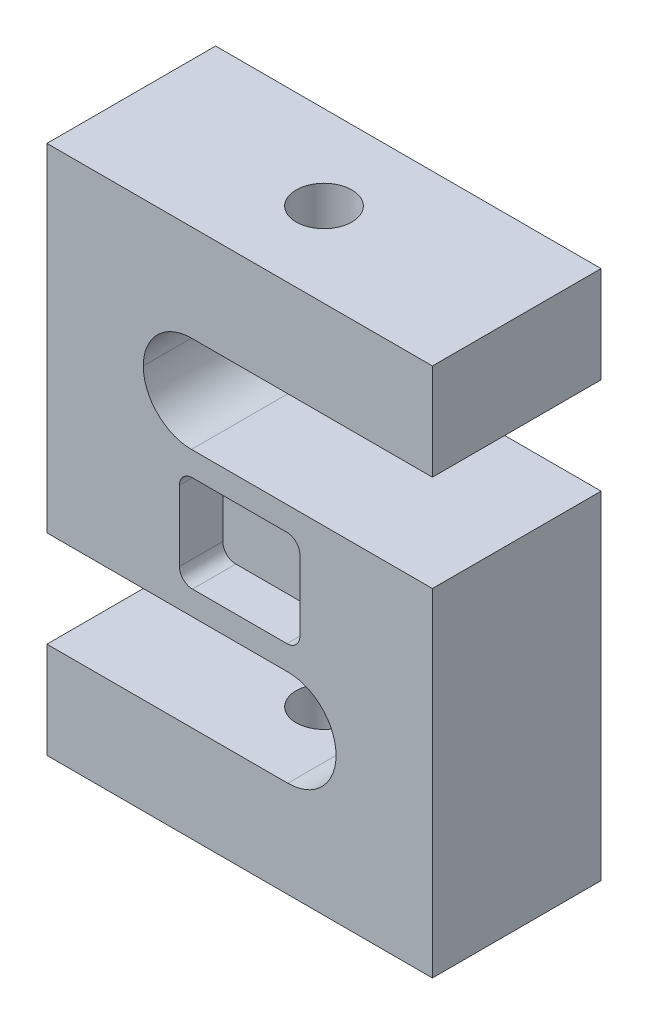
ISO-10303-21;
HEADER;
FILE_DESCRIPTION(('STEP AP214'),'2;1');
FILE_NAME('part.step','',(''),(''),'','','');
FILE_SCHEMA(('AUTOMOTIVE_DESIGN { 1 0 10303 214 1 1 1 1 }'));
ENDSEC;
DATA;
#1=APPLICATION_CONTEXT('core data for automotive mechanical design processes');
#2=APPLICATION_PROTOCOL_DEFINITION('international standard','automotive_design',2000,#1);
#3=PRODUCT_CONTEXT('',#1,'mechanical');
#4=PRODUCT('Part','Part','',(#3));
#5=PRODUCT_RELATED_PRODUCT_CATEGORY('part','',(#4));
#6=PRODUCT_DEFINITION_FORMATION('','',#4);
#7=PRODUCT_DEFINITION_CONTEXT('part definition',#1,'design');
#8=PRODUCT_DEFINITION('design','',#6,#7);
#9=PRODUCT_DEFINITION_SHAPE('','',#8);
#10=(LENGTH_UNIT() NAMED_UNIT(*) SI_UNIT(.MILLI.,.METRE.));
#11=(NAMED_UNIT(*) PLANE_ANGLE_UNIT() SI_UNIT($,.RADIAN.));
#12=(NAMED_UNIT(*) SI_UNIT($,.STERADIAN.) SOLID_ANGLE_UNIT());
#13=UNCERTAINTY_MEASURE_WITH_UNIT(LENGTH_MEASURE(1.E-05),#10,'distance_accuracy_value','');
#14=(GEOMETRIC_REPRESENTATION_CONTEXT(3) GLOBAL_UNCERTAINTY_ASSIGNED_CONTEXT((#13)) GLOBAL_UNIT_ASSIGNED_CONTEXT((#10,
#11,#12)) REPRESENTATION_CONTEXT('',''));
#15=CARTESIAN_POINT('',(0.,0.,0.));
#16=DIRECTION('',(0.,0.,1.));
#17=DIRECTION('',(1.,0.,0.));
#18=AXIS2_PLACEMENT_3D('',#15,#16,#17);
#19=CARTESIAN_POINT('',(76.2,-88.9,-22.225));
#20=DIRECTION('',(0.,0.,-1.));
#21=DIRECTION('',(-1.,0.,0.));
#22=AXIS2_PLACEMENT_3D('',#19,#20,#21);
#23=PLANE('',#22);
#24=DIRECTION('',(0.,1.,0.));
#25=VECTOR('',#24,1.);
#26=CARTESIAN_POINT('',(76.2,0.,-22.225));
#27=LINE('',#26,#25);
#28=CARTESIAN_POINT('',(76.2,-88.9,-22.225));
#29=VERTEX_POINT('',#28);
#30=CARTESIAN_POINT('',(76.2,0.,-22.225));
#31=VERTEX_POINT('',#30);
#32=EDGE_CURVE('E264',#29,#31,#27,.T.);
#33=ORIENTED_EDGE('',*,*,#32,.F.);
#34=DIRECTION('',(1.,0.,0.));
#35=VECTOR('',#34,1.);
#36=CARTESIAN_POINT('',(76.2,-88.9,-22.225));
#37=LINE('',#36,#35);
#38=CARTESIAN_POINT('',(-25.4,-88.9,-22.225));
#39=VERTEX_POINT('',#38);
#40=EDGE_CURVE('E260',#39,#29,#37,.T.);
#41=ORIENTED_EDGE('',*,*,#40,.F.);
#42=DIRECTION('',(0.,-1.,0.));
#43=VECTOR('',#42,1.);
#44=CARTESIAN_POINT('',(-25.4,-88.9,-22.225));
#45=LINE('',#44,#43);
#46=CARTESIAN_POINT('',(-25.4,-63.5,-22.225));
#47=VERTEX_POINT('',#46);
#48=EDGE_CURVE('E484',#47,#39,#45,.T.);
#49=ORIENTED_EDGE('',*,*,#48,.F.);
#50=DIRECTION('',(-1.,0.,0.));
#51=VECTOR('',#50,1.);
#52=CARTESIAN_POINT('',(-25.4,-63.5,-22.225));
#53=LINE('',#52,#51);
#54=CARTESIAN_POINT('',(38.1,-63.5,-22.225));
#55=VERTEX_POINT('',#54);
#56=EDGE_CURVE('E482',#55,#47,#53,.T.);
#57=ORIENTED_EDGE('',*,*,#56,.F.);
#58=CARTESIAN_POINT('',(38.1,-50.8,-22.225));
#59=DIRECTION('',(0.,0.,-1.));
#60=DIRECTION('',(-1.,0.,0.));
#61=AXIS2_PLACEMENT_3D('',#58,#59,#60);
#62=CIRCLE('',#61,12.7);
#63=CARTESIAN_POINT('',(50.8,-50.8,-22.225));
#64=VERTEX_POINT('',#63);
#65=EDGE_CURVE('E282',#55,#64,#62,.F.);
#66=ORIENTED_EDGE('',*,*,#65,.T.);
#67=CARTESIAN_POINT('',(38.1,-50.8,-22.225));
#68=DIRECTION('',(0.,0.,-1.));
#69=DIRECTION('',(-1.,0.,0.));
#70=AXIS2_PLACEMENT_3D('',#67,#68,#69);
#71=CIRCLE('',#70,12.7);
#72=CARTESIAN_POINT('',(38.1,-38.1,-22.225));
#73=VERTEX_POINT('',#72);
#74=EDGE_CURVE('E286',#64,#73,#71,.F.);
#75=ORIENTED_EDGE('',*,*,#74,.T.);
#76=DIRECTION('',(1.,0.,0.));
#77=VECTOR('',#76,1.);
#78=CARTESIAN_POINT('',(50.8,-38.1,-22.225));
#79=LINE('',#78,#77);
#80=CARTESIAN_POINT('',(-25.4,-38.1,-22.225));
#81=VERTEX_POINT('',#80);
#82=EDGE_CURVE('E479',#81,#73,#79,.T.);
#83=ORIENTED_EDGE('',*,*,#82,.F.);
#84=DIRECTION('',(0.,-1.,0.));
#85=VECTOR('',#84,1.);
#86=CARTESIAN_POINT('',(-25.4,-38.1,-22.225));
#87=LINE('',#86,#85);
#88=CARTESIAN_POINT('',(-25.4,50.8,-22.225));
#89=VERTEX_POINT('',#88);
#90=EDGE_CURVE('E477',#89,#81,#87,.T.);
#91=ORIENTED_EDGE('',*,*,#90,.F.);
#92=DIRECTION('',(-1.,0.,0.));
#93=VECTOR('',#92,1.);
#94=CARTESIAN_POINT('',(-25.4,50.8,-22.225));
#95=LINE('',#94,#93);
#96=CARTESIAN_POINT('',(76.2,50.8,-22.225));
#97=VERTEX_POINT('',#96);
#98=EDGE_CURVE('E475',#97,#89,#95,.T.);
#99=ORIENTED_EDGE('',*,*,#98,.F.);
#100=DIRECTION('',(0.,1.,0.));
#101=VECTOR('',#100,1.);
#102=CARTESIAN_POINT('',(76.2,50.8,-22.225));
#103=LINE('',#102,#101);
#104=CARTESIAN_POINT('',(76.2,25.4,-22.225));
#105=VERTEX_POINT('',#104);
#106=EDGE_CURVE('E473',#105,#97,#103,.T.);
#107=ORIENTED_EDGE('',*,*,#106,.F.);
#108=DIRECTION('',(1.,0.,0.));
#109=VECTOR('',#108,1.);
#110=CARTESIAN_POINT('',(76.2,25.4,-22.225));
#111=LINE('',#110,#109);
#112=CARTESIAN_POINT('',(12.7,25.4,-22.225));
#113=VERTEX_POINT('',#112);
#114=EDGE_CURVE('E471',#113,#105,#111,.T.);
#115=ORIENTED_EDGE('',*,*,#114,.F.);
#116=CARTESIAN_POINT('',(12.7,12.7,-22.225));
#117=DIRECTION('',(0.,0.,-1.));
#118=DIRECTION('',(-1.,0.,0.));
#119=AXIS2_PLACEMENT_3D('',#116,#117,#118);
#120=CIRCLE('',#119,12.7);
#121=CARTESIAN_POINT('',(0.,12.7,-22.225));
#122=VERTEX_POINT('',#121);
#123=EDGE_CURVE('E290',#113,#122,#120,.F.);
#124=ORIENTED_EDGE('',*,*,#123,.T.);
#125=CARTESIAN_POINT('',(12.7,12.7,-22.225));
#126=DIRECTION('',(0.,0.,-1.));
#127=DIRECTION('',(-1.,0.,0.));
#128=AXIS2_PLACEMENT_3D('',#125,#126,#127);
#129=CIRCLE('',#128,12.7);
#130=CARTESIAN_POINT('',(12.7,0.,-22.225));
#131=VERTEX_POINT('',#130);
#132=EDGE_CURVE('E295',#122,#131,#129,.F.);
#133=ORIENTED_EDGE('',*,*,#132,.T.);
#134=DIRECTION('',(-1.,0.,0.));
#135=VECTOR('',#134,1.);
#136=CARTESIAN_POINT('',(76.2,0.,-22.225));
#137=LINE('',#136,#135);
#138=EDGE_CURVE('E468',#31,#131,#137,.T.);
#139=ORIENTED_EDGE('',*,*,#138,.F.);
#140=EDGE_LOOP('',(#33,#41,#49,#57,#66,#75,#83,#91,#99,#107,#115,#124,#133,#139));
#141=FACE_BOUND('',#140,.T.);
#142=DIRECTION('',(0.,-1.,0.));
#143=VECTOR('',#142,1.);
#144=CARTESIAN_POINT('',(9.525,-31.75,-22.225));
#145=LINE('',#144,#143);
#146=CARTESIAN_POINT('',(9.525,-9.779,-22.225));
#147=VERTEX_POINT('',#146);
#148=CARTESIAN_POINT('',(9.525,-28.321,-22.225));
#149=VERTEX_POINT('',#148);
#150=EDGE_CURVE('E414',#147,#149,#145,.T.);
#151=ORIENTED_EDGE('',*,*,#150,.T.);
#152=CARTESIAN_POINT('',(12.954,-28.321,-22.225));
#153=DIRECTION('',(0.,0.,-1.));
#154=DIRECTION('',(-1.,0.,0.));
#155=AXIS2_PLACEMENT_3D('',#152,#153,#154);
#156=CIRCLE('',#155,3.429);
#157=CARTESIAN_POINT('',(12.954,-31.75,-22.225));
#158=VERTEX_POINT('',#157);
#159=EDGE_CURVE('E372',#149,#158,#156,.F.);
#160=ORIENTED_EDGE('',*,*,#159,.T.);
#161=DIRECTION('',(1.,0.,0.));
#162=VECTOR('',#161,1.);
#163=CARTESIAN_POINT('',(9.525,-31.75,-22.225));
#164=LINE('',#163,#162);
#165=CARTESIAN_POINT('',(37.846,-31.75,-22.225));
#166=VERTEX_POINT('',#165);
#167=EDGE_CURVE('E380',#158,#166,#164,.T.);
#168=ORIENTED_EDGE('',*,*,#167,.T.);
#169=CARTESIAN_POINT('',(37.846,-28.321,-22.225));
#170=DIRECTION('',(0.,0.,-1.));
#171=DIRECTION('',(-1.,0.,0.));
#172=AXIS2_PLACEMENT_3D('',#169,#170,#171);
#173=CIRCLE('',#172,3.429);
#174=CARTESIAN_POINT('',(41.275,-28.321,-22.225));
#175=VERTEX_POINT('',#174);
#176=EDGE_CURVE('E374',#166,#175,#173,.F.);
#177=ORIENTED_EDGE('',*,*,#176,.T.);
#178=DIRECTION('',(0.,1.,0.));
#179=VECTOR('',#178,1.);
#180=CARTESIAN_POINT('',(41.275,-31.75,-22.225));
#181=LINE('',#180,#179);
#182=CARTESIAN_POINT('',(41.275,-9.779,-22.225));
#183=VERTEX_POINT('',#182);
#184=EDGE_CURVE('E378',#175,#183,#181,.T.);
#185=ORIENTED_EDGE('',*,*,#184,.T.);
#186=CARTESIAN_POINT('',(37.846,-9.779,-22.225));
#187=DIRECTION('',(0.,0.,-1.));
#188=DIRECTION('',(-1.,0.,0.));
#189=AXIS2_PLACEMENT_3D('',#186,#187,#188);
#190=CIRCLE('',#189,3.429);
#191=CARTESIAN_POINT('',(37.846,-6.35,-22.225));
#192=VERTEX_POINT('',#191);
#193=EDGE_CURVE('E48',#183,#192,#190,.F.);
#194=ORIENTED_EDGE('',*,*,#193,.T.);
#195=DIRECTION('',(-1.,0.,0.));
#196=VECTOR('',#195,1.);
#197=CARTESIAN_POINT('',(9.525,-6.35,-22.225));
#198=LINE('',#197,#196);
#199=CARTESIAN_POINT('',(12.954,-6.35,-22.225));
#200=VERTEX_POINT('',#199);
#201=EDGE_CURVE('E407',#192,#200,#198,.T.);
#202=ORIENTED_EDGE('',*,*,#201,.T.);
#203=CARTESIAN_POINT('',(12.954,-9.77900000000001,-22.225));
#204=DIRECTION('',(0.,0.,-1.));
#205=DIRECTION('',(-1.,0.,0.));
#206=AXIS2_PLACEMENT_3D('',#203,#204,#205);
#207=CIRCLE('',#206,3.429);
#208=EDGE_CURVE('E11',#200,#147,#207,.F.);
#209=ORIENTED_EDGE('',*,*,#208,.T.);
#210=EDGE_LOOP('',(#151,#160,#168,#177,#185,#194,#202,#209));
#211=FACE_BOUND('',#210,.T.);
#212=ADVANCED_FACE('F40',(#141,#211),#23,.T.);
#213=CARTESIAN_POINT('',(-25.4,50.8,22.225));
#214=DIRECTION('',(0.,-1.,0.));
#215=DIRECTION('',(0.,0.,-1.));
#216=AXIS2_PLACEMENT_3D('',#213,#214,#215);
#217=PLANE('',#216);
#218=ORIENTED_EDGE('',*,*,#98,.T.);
#219=DIRECTION('',(0.,0.,-1.));
#220=VECTOR('',#219,1.);
#221=CARTESIAN_POINT('',(-25.4,50.8,22.225));
#222=LINE('',#221,#220);
#223=CARTESIAN_POINT('',(-25.4,50.8,22.225));
#224=VERTEX_POINT('',#223);
#225=EDGE_CURVE('E497',#224,#89,#222,.T.);
#226=ORIENTED_EDGE('',*,*,#225,.F.);
#227=DIRECTION('',(-1.,0.,0.));
#228=VECTOR('',#227,1.);
#229=CARTESIAN_POINT('',(-25.4,50.8,22.225));
#230=LINE('',#229,#228);
#231=CARTESIAN_POINT('',(76.2,50.8,22.225));
#232=VERTEX_POINT('',#231);
#233=EDGE_CURVE('E454',#232,#224,#230,.T.);
#234=ORIENTED_EDGE('',*,*,#233,.F.);
#235=DIRECTION('',(0.,0.,-1.));
#236=VECTOR('',#235,1.);
#237=CARTESIAN_POINT('',(76.2,50.8,22.225));
#238=LINE('',#237,#236);
#239=EDGE_CURVE('E272',#232,#97,#238,.T.);
#240=ORIENTED_EDGE('',*,*,#239,.T.);
#241=EDGE_LOOP('',(#218,#226,#234,#240));
#242=FACE_BOUND('',#241,.T.);
#243=CARTESIAN_POINT('',(25.4,50.8,0.));
#244=DIRECTION('',(0.,1.,0.));
#245=DIRECTION('',(0.,0.,1.));
#246=AXIS2_PLACEMENT_3D('',#243,#244,#245);
#247=CIRCLE('',#246,7.34186999999999);
#248=CARTESIAN_POINT('',(25.4,50.8,7.34186999999998));
#249=VERTEX_POINT('',#248);
#250=EDGE_CURVE('E430',#249,#249,#247,.T.);
#251=ORIENTED_EDGE('',*,*,#250,.F.);
#252=EDGE_LOOP('',(#251));
#253=FACE_BOUND('',#252,.T.);
#254=ADVANCED_FACE('F504',(#242,#253),#217,.F.);
#255=CARTESIAN_POINT('',(76.2,-88.9,22.225));
#256=DIRECTION('',(0.,1.,0.));
#257=DIRECTION('',(0.,0.,1.));
#258=AXIS2_PLACEMENT_3D('',#255,#256,#257);
#259=PLANE('',#258);
#260=ORIENTED_EDGE('',*,*,#40,.T.);
#261=DIRECTION('',(0.,0.,-1.));
#262=VECTOR('',#261,1.);
#263=CARTESIAN_POINT('',(76.2,-88.9,22.225));
#264=LINE('',#263,#262);
#265=CARTESIAN_POINT('',(76.2,-88.9,22.225));
#266=VERTEX_POINT('',#265);
#267=EDGE_CURVE('E466',#266,#29,#264,.T.);
#268=ORIENTED_EDGE('',*,*,#267,.F.);
#269=DIRECTION('',(1.,0.,0.));
#270=VECTOR('',#269,1.);
#271=CARTESIAN_POINT('',(76.2,-88.9,22.225));
#272=LINE('',#271,#270);
#273=CARTESIAN_POINT('',(-25.4,-88.9,22.225));
#274=VERTEX_POINT('',#273);
#275=EDGE_CURVE('E256',#274,#266,#272,.T.);
#276=ORIENTED_EDGE('',*,*,#275,.F.);
#277=DIRECTION('',(0.,0.,-1.));
#278=VECTOR('',#277,1.);
#279=CARTESIAN_POINT('',(-25.4,-88.9,22.225));
#280=LINE('',#279,#278);
#281=EDGE_CURVE('E488',#274,#39,#280,.T.);
#282=ORIENTED_EDGE('',*,*,#281,.T.);
#283=EDGE_LOOP('',(#260,#268,#276,#282));
#284=FACE_BOUND('',#283,.T.);
#285=CARTESIAN_POINT('',(25.4,-88.9,0.));
#286=DIRECTION('',(0.,-1.,0.));
#287=DIRECTION('',(0.,0.,-1.));
#288=AXIS2_PLACEMENT_3D('',#285,#286,#287);
#289=CIRCLE('',#288,7.34186999999999);
#290=CARTESIAN_POINT('',(25.4,-88.9,-7.34186999999998));
#291=VERTEX_POINT('',#290);
#292=EDGE_CURVE('E446',#291,#291,#289,.T.);
#293=ORIENTED_EDGE('',*,*,#292,.F.);
#294=EDGE_LOOP('',(#293));
#295=FACE_BOUND('',#294,.T.);
#296=ADVANCED_FACE('F543',(#284,#295),#259,.F.);
#297=CARTESIAN_POINT('',(76.2,0.,22.225));
#298=DIRECTION('',(-1.,0.,0.));
#299=DIRECTION('',(0.,0.,1.));
#300=AXIS2_PLACEMENT_3D('',#297,#298,#299);
#301=PLANE('',#300);
#302=ORIENTED_EDGE('',*,*,#32,.T.);
#303=DIRECTION('',(0.,0.,-1.));
#304=VECTOR('',#303,1.);
#305=CARTESIAN_POINT('',(76.2,0.,22.225));
#306=LINE('',#305,#304);
#307=CARTESIAN_POINT('',(76.2,0.,22.225));
#308=VERTEX_POINT('',#307);
#309=EDGE_CURVE('E243',#308,#31,#306,.T.);
#310=ORIENTED_EDGE('',*,*,#309,.F.);
#311=DIRECTION('',(0.,1.,0.));
#312=VECTOR('',#311,1.);
#313=CARTESIAN_POINT('',(76.2,0.,22.225));
#314=LINE('',#313,#312);
#315=EDGE_CURVE('E251',#266,#308,#314,.T.);
#316=ORIENTED_EDGE('',*,*,#315,.F.);
#317=ORIENTED_EDGE('',*,*,#267,.T.);
#318=EDGE_LOOP('',(#302,#310,#316,#317));
#319=FACE_BOUND('',#318,.T.);
#320=ADVANCED_FACE('F262',(#319),#301,.F.);
#321=CARTESIAN_POINT('',(76.2,0.,22.225));
#322=DIRECTION('',(0.,-1.,0.));
#323=DIRECTION('',(0.,0.,-1.));
#324=AXIS2_PLACEMENT_3D('',#321,#322,#323);
#325=PLANE('',#324);
#326=ORIENTED_EDGE('',*,*,#138,.T.);
#327=DIRECTION('',(0.,0.,-1.));
#328=VECTOR('',#327,1.);
#329=CARTESIAN_POINT('',(12.7,0.,22.225));
#330=LINE('',#329,#328);
#331=CARTESIAN_POINT('',(12.7,0.,22.225));
#332=VERTEX_POINT('',#331);
#333=EDGE_CURVE('E246',#131,#332,#330,.F.);
#334=ORIENTED_EDGE('',*,*,#333,.T.);
#335=DIRECTION('',(-1.,0.,0.));
#336=VECTOR('',#335,1.);
#337=CARTESIAN_POINT('',(76.2,0.,22.225));
#338=LINE('',#337,#336);
#339=EDGE_CURVE('E238',#308,#332,#338,.T.);
#340=ORIENTED_EDGE('',*,*,#339,.F.);
#341=ORIENTED_EDGE('',*,*,#309,.T.);
#342=EDGE_LOOP('',(#326,#334,#340,#341));
#343=FACE_BOUND('',#342,.T.);
#344=ADVANCED_FACE('F241',(#343),#325,.F.);
#345=CARTESIAN_POINT('',(76.2,25.4,22.225));
#346=DIRECTION('',(0.,1.,0.));
#347=DIRECTION('',(-1.,0.,0.));
#348=AXIS2_PLACEMENT_3D('',#345,#346,#347);
#349=PLANE('',#348);
#350=CARTESIAN_POINT('',(25.4,25.4,0.));
#351=DIRECTION('',(0.,1.,0.));
#352=DIRECTION('',(-1.,0.,0.));
#353=AXIS2_PLACEMENT_3D('',#350,#351,#352);
#354=CIRCLE('',#353,7.34186999999999);
#355=CARTESIAN_POINT('',(18.05813,25.4,0.));
#356=VERTEX_POINT('',#355);
#357=EDGE_CURVE('E443',#356,#356,#354,.T.);
#358=ORIENTED_EDGE('',*,*,#357,.T.);
#359=EDGE_LOOP('',(#358));
#360=FACE_BOUND('',#359,.T.);
#361=DIRECTION('',(1.,0.,0.));
#362=VECTOR('',#361,1.);
#363=CARTESIAN_POINT('',(76.2,25.4,22.225));
#364=LINE('',#363,#362);
#365=CARTESIAN_POINT('',(12.7,25.4,22.225));
#366=VERTEX_POINT('',#365);
#367=CARTESIAN_POINT('',(76.2,25.4,22.225));
#368=VERTEX_POINT('',#367);
#369=EDGE_CURVE('E250',#366,#368,#364,.T.);
#370=ORIENTED_EDGE('',*,*,#369,.F.);
#371=DIRECTION('',(0.,0.,-1.));
#372=VECTOR('',#371,1.);
#373=CARTESIAN_POINT('',(12.7,25.4,-22.225));
#374=LINE('',#373,#372);
#375=EDGE_CURVE('E277',#366,#113,#374,.T.);
#376=ORIENTED_EDGE('',*,*,#375,.T.);
#377=ORIENTED_EDGE('',*,*,#114,.T.);
#378=DIRECTION('',(0.,0.,-1.));
#379=VECTOR('',#378,1.);
#380=CARTESIAN_POINT('',(76.2,25.4,22.225));
#381=LINE('',#380,#379);
#382=EDGE_CURVE('E266',#368,#105,#381,.T.);
#383=ORIENTED_EDGE('',*,*,#382,.F.);
#384=EDGE_LOOP('',(#370,#376,#377,#383));
#385=FACE_BOUND('',#384,.T.);
#386=ADVANCED_FACE('F555',(#360,#385),#349,.F.);
#387=CARTESIAN_POINT('',(76.2,50.8,22.225));
#388=DIRECTION('',(-1.,0.,0.));
#389=DIRECTION('',(0.,0.,1.));
#390=AXIS2_PLACEMENT_3D('',#387,#388,#389);
#391=PLANE('',#390);
#392=ORIENTED_EDGE('',*,*,#106,.T.);
#393=ORIENTED_EDGE('',*,*,#239,.F.);
#394=DIRECTION('',(0.,1.,0.));
#395=VECTOR('',#394,1.);
#396=CARTESIAN_POINT('',(76.2,50.8,22.225));
#397=LINE('',#396,#395);
#398=EDGE_CURVE('E452',#368,#232,#397,.T.);
#399=ORIENTED_EDGE('',*,*,#398,.F.);
#400=ORIENTED_EDGE('',*,*,#382,.T.);
#401=EDGE_LOOP('',(#392,#393,#399,#400));
#402=FACE_BOUND('',#401,.T.);
#403=ADVANCED_FACE('F557',(#402),#391,.F.);
#404=CARTESIAN_POINT('',(-25.4,-38.1,22.225));
#405=DIRECTION('',(1.,0.,0.));
#406=DIRECTION('',(0.,0.,-1.));
#407=AXIS2_PLACEMENT_3D('',#404,#405,#406);
#408=PLANE('',#407);
#409=ORIENTED_EDGE('',*,*,#90,.T.);
#410=DIRECTION('',(0.,0.,-1.));
#411=VECTOR('',#410,1.);
#412=CARTESIAN_POINT('',(-25.4,-38.1,22.225));
#413=LINE('',#412,#411);
#414=CARTESIAN_POINT('',(-25.4,-38.1,22.225));
#415=VERTEX_POINT('',#414);
#416=EDGE_CURVE('E494',#415,#81,#413,.T.);
#417=ORIENTED_EDGE('',*,*,#416,.F.);
#418=DIRECTION('',(0.,-1.,0.));
#419=VECTOR('',#418,1.);
#420=CARTESIAN_POINT('',(-25.4,-38.1,22.225));
#421=LINE('',#420,#419);
#422=EDGE_CURVE('E456',#224,#415,#421,.T.);
#423=ORIENTED_EDGE('',*,*,#422,.F.);
#424=ORIENTED_EDGE('',*,*,#225,.T.);
#425=EDGE_LOOP('',(#409,#417,#423,#424));
#426=FACE_BOUND('',#425,.T.);
#427=ADVANCED_FACE('F516',(#426),#408,.F.);
#428=CARTESIAN_POINT('',(50.8,-38.1,22.225));
#429=DIRECTION('',(0.,1.,0.));
#430=DIRECTION('',(0.,0.,1.));
#431=AXIS2_PLACEMENT_3D('',#428,#429,#430);
#432=PLANE('',#431);
#433=ORIENTED_EDGE('',*,*,#82,.T.);
#434=DIRECTION('',(0.,0.,-1.));
#435=VECTOR('',#434,1.);
#436=CARTESIAN_POINT('',(38.1,-38.1,22.225));
#437=LINE('',#436,#435);
#438=CARTESIAN_POINT('',(38.1,-38.1,22.225));
#439=VERTEX_POINT('',#438);
#440=EDGE_CURVE('E269',#73,#439,#437,.F.);
#441=ORIENTED_EDGE('',*,*,#440,.T.);
#442=DIRECTION('',(1.,0.,0.));
#443=VECTOR('',#442,1.);
#444=CARTESIAN_POINT('',(50.8,-38.1,22.225));
#445=LINE('',#444,#443);
#446=EDGE_CURVE('E458',#415,#439,#445,.T.);
#447=ORIENTED_EDGE('',*,*,#446,.F.);
#448=ORIENTED_EDGE('',*,*,#416,.T.);
#449=EDGE_LOOP('',(#433,#441,#447,#448));
#450=FACE_BOUND('',#449,.T.);
#451=ADVANCED_FACE('F520',(#450),#432,.F.);
#452=CARTESIAN_POINT('',(-25.4,-63.5,22.225));
#453=DIRECTION('',(0.,-1.,0.));
#454=DIRECTION('',(0.,0.,-1.));
#455=AXIS2_PLACEMENT_3D('',#452,#453,#454);
#456=PLANE('',#455);
#457=CARTESIAN_POINT('',(25.4,-63.5,0.));
#458=DIRECTION('',(0.,-1.,0.));
#459=DIRECTION('',(0.,0.,-1.));
#460=AXIS2_PLACEMENT_3D('',#457,#458,#459);
#461=CIRCLE('',#460,7.34186999999999);
#462=CARTESIAN_POINT('',(25.4,-63.5,-7.34186999999999));
#463=VERTEX_POINT('',#462);
#464=EDGE_CURVE('E309',#463,#463,#461,.T.);
#465=ORIENTED_EDGE('',*,*,#464,.T.);
#466=EDGE_LOOP('',(#465));
#467=FACE_BOUND('',#466,.T.);
#468=DIRECTION('',(-1.,0.,0.));
#469=VECTOR('',#468,1.);
#470=CARTESIAN_POINT('',(-25.4,-63.5,22.225));
#471=LINE('',#470,#469);
#472=CARTESIAN_POINT('',(38.1,-63.5,22.225));
#473=VERTEX_POINT('',#472);
#474=CARTESIAN_POINT('',(-25.4,-63.5,22.225));
#475=VERTEX_POINT('',#474);
#476=EDGE_CURVE('E461',#473,#475,#471,.T.);
#477=ORIENTED_EDGE('',*,*,#476,.F.);
#478=DIRECTION('',(0.,0.,-1.));
#479=VECTOR('',#478,1.);
#480=CARTESIAN_POINT('',(38.1,-63.5,-22.225));
#481=LINE('',#480,#479);
#482=EDGE_CURVE('E265',#473,#55,#481,.T.);
#483=ORIENTED_EDGE('',*,*,#482,.T.);
#484=ORIENTED_EDGE('',*,*,#56,.T.);
#485=DIRECTION('',(0.,0.,-1.));
#486=VECTOR('',#485,1.);
#487=CARTESIAN_POINT('',(-25.4,-63.5,22.225));
#488=LINE('',#487,#486);
#489=EDGE_CURVE('E491',#475,#47,#488,.T.);
#490=ORIENTED_EDGE('',*,*,#489,.F.);
#491=EDGE_LOOP('',(#477,#483,#484,#490));
#492=FACE_BOUND('',#491,.T.);
#493=ADVANCED_FACE('F534',(#467,#492),#456,.F.);
#494=CARTESIAN_POINT('',(-25.4,-88.9,22.225));
#495=DIRECTION('',(1.,0.,0.));
#496=DIRECTION('',(0.,0.,-1.));
#497=AXIS2_PLACEMENT_3D('',#494,#495,#496);
#498=PLANE('',#497);
#499=ORIENTED_EDGE('',*,*,#48,.T.);
#500=ORIENTED_EDGE('',*,*,#281,.F.);
#501=DIRECTION('',(0.,-1.,0.));
#502=VECTOR('',#501,1.);
#503=CARTESIAN_POINT('',(-25.4,-88.9,22.225));
#504=LINE('',#503,#502);
#505=EDGE_CURVE('E463',#475,#274,#504,.T.);
#506=ORIENTED_EDGE('',*,*,#505,.F.);
#507=ORIENTED_EDGE('',*,*,#489,.T.);
#508=EDGE_LOOP('',(#499,#500,#506,#507));
#509=FACE_BOUND('',#508,.T.);
#510=ADVANCED_FACE('F540',(#509),#498,.F.);
#511=CARTESIAN_POINT('',(76.2,-88.9,22.225));
#512=DIRECTION('',(0.,0.,-1.));
#513=DIRECTION('',(-1.,0.,0.));
#514=AXIS2_PLACEMENT_3D('',#511,#512,#513);
#515=PLANE('',#514);
#516=DIRECTION('',(-1.,0.,0.));
#517=VECTOR('',#516,1.);
#518=CARTESIAN_POINT('',(9.525,-6.35,22.225));
#519=LINE('',#518,#517);
#520=CARTESIAN_POINT('',(37.846,-6.35,22.225));
#521=VERTEX_POINT('',#520);
#522=CARTESIAN_POINT('',(12.954,-6.35,22.225));
#523=VERTEX_POINT('',#522);
#524=EDGE_CURVE('E433',#521,#523,#519,.T.);
#525=ORIENTED_EDGE('',*,*,#524,.F.);
#526=CARTESIAN_POINT('',(37.846,-9.77900000000001,22.225));
#527=DIRECTION('',(0.,0.,-1.));
#528=DIRECTION('',(-1.,0.,0.));
#529=AXIS2_PLACEMENT_3D('',#526,#527,#528);
#530=CIRCLE('',#529,3.429);
#531=CARTESIAN_POINT('',(41.275,-9.779,22.225));
#532=VERTEX_POINT('',#531);
#533=EDGE_CURVE('E341',#521,#532,#530,.T.);
#534=ORIENTED_EDGE('',*,*,#533,.T.);
#535=DIRECTION('',(0.,1.,0.));
#536=VECTOR('',#535,1.);
#537=CARTESIAN_POINT('',(41.275,-31.75,22.225));
#538=LINE('',#537,#536);
#539=CARTESIAN_POINT('',(41.275,-28.321,22.225));
#540=VERTEX_POINT('',#539);
#541=EDGE_CURVE('E411',#540,#532,#538,.T.);
#542=ORIENTED_EDGE('',*,*,#541,.F.);
#543=CARTESIAN_POINT('',(37.846,-28.321,22.225));
#544=DIRECTION('',(0.,0.,-1.));
#545=DIRECTION('',(-1.,0.,0.));
#546=AXIS2_PLACEMENT_3D('',#543,#544,#545);
#547=CIRCLE('',#546,3.429);
#548=CARTESIAN_POINT('',(37.846,-31.75,22.225));
#549=VERTEX_POINT('',#548);
#550=EDGE_CURVE('E339',#540,#549,#547,.T.);
#551=ORIENTED_EDGE('',*,*,#550,.T.);
#552=DIRECTION('',(1.,0.,0.));
#553=VECTOR('',#552,1.);
#554=CARTESIAN_POINT('',(9.525,-31.75,22.225));
#555=LINE('',#554,#553);
#556=CARTESIAN_POINT('',(12.954,-31.75,22.225));
#557=VERTEX_POINT('',#556);
#558=EDGE_CURVE('E421',#557,#549,#555,.T.);
#559=ORIENTED_EDGE('',*,*,#558,.F.);
#560=CARTESIAN_POINT('',(12.954,-28.321,22.225));
#561=DIRECTION('',(0.,0.,-1.));
#562=DIRECTION('',(-1.,0.,0.));
#563=AXIS2_PLACEMENT_3D('',#560,#561,#562);
#564=CIRCLE('',#563,3.429);
#565=CARTESIAN_POINT('',(9.525,-28.321,22.225));
#566=VERTEX_POINT('',#565);
#567=EDGE_CURVE('E337',#557,#566,#564,.T.);
#568=ORIENTED_EDGE('',*,*,#567,.T.);
#569=DIRECTION('',(0.,-1.,0.));
#570=VECTOR('',#569,1.);
#571=CARTESIAN_POINT('',(9.525,-31.75,22.225));
#572=LINE('',#571,#570);
#573=CARTESIAN_POINT('',(9.525,-9.779,22.225));
#574=VERTEX_POINT('',#573);
#575=EDGE_CURVE('E436',#574,#566,#572,.T.);
#576=ORIENTED_EDGE('',*,*,#575,.F.);
#577=CARTESIAN_POINT('',(12.954,-9.779,22.225));
#578=DIRECTION('',(0.,0.,-1.));
#579=DIRECTION('',(-1.,0.,0.));
#580=AXIS2_PLACEMENT_3D('',#577,#578,#579);
#581=CIRCLE('',#580,3.429);
#582=EDGE_CURVE('E343',#574,#523,#581,.T.);
#583=ORIENTED_EDGE('',*,*,#582,.T.);
#584=EDGE_LOOP('',(#525,#534,#542,#551,#559,#568,#576,#583));
#585=FACE_BOUND('',#584,.T.);
#586=ORIENTED_EDGE('',*,*,#315,.T.);
#587=ORIENTED_EDGE('',*,*,#339,.T.);
#588=CARTESIAN_POINT('',(12.7,12.7,22.225));
#589=DIRECTION('',(0.,0.,-1.));
#590=DIRECTION('',(-1.,0.,0.));
#591=AXIS2_PLACEMENT_3D('',#588,#589,#590);
#592=CIRCLE('',#591,12.7);
#593=CARTESIAN_POINT('',(0.,12.7,22.225));
#594=VERTEX_POINT('',#593);
#595=EDGE_CURVE('E298',#332,#594,#592,.T.);
#596=ORIENTED_EDGE('',*,*,#595,.T.);
#597=CARTESIAN_POINT('',(12.7,12.7,22.225));
#598=DIRECTION('',(0.,0.,-1.));
#599=DIRECTION('',(-1.,0.,0.));
#600=AXIS2_PLACEMENT_3D('',#597,#598,#599);
#601=CIRCLE('',#600,12.7);
#602=EDGE_CURVE('E293',#594,#366,#601,.T.);
#603=ORIENTED_EDGE('',*,*,#602,.T.);
#604=ORIENTED_EDGE('',*,*,#369,.T.);
#605=ORIENTED_EDGE('',*,*,#398,.T.);
#606=ORIENTED_EDGE('',*,*,#233,.T.);
#607=ORIENTED_EDGE('',*,*,#422,.T.);
#608=ORIENTED_EDGE('',*,*,#446,.T.);
#609=CARTESIAN_POINT('',(38.1,-50.8,22.225));
#610=DIRECTION('',(0.,0.,-1.));
#611=DIRECTION('',(-1.,0.,0.));
#612=AXIS2_PLACEMENT_3D('',#609,#610,#611);
#613=CIRCLE('',#612,12.7);
#614=CARTESIAN_POINT('',(50.8,-50.8,22.225));
#615=VERTEX_POINT('',#614);
#616=EDGE_CURVE('E288',#439,#615,#613,.T.);
#617=ORIENTED_EDGE('',*,*,#616,.T.);
#618=CARTESIAN_POINT('',(38.1,-50.8,22.225));
#619=DIRECTION('',(0.,0.,-1.));
#620=DIRECTION('',(-1.,0.,0.));
#621=AXIS2_PLACEMENT_3D('',#618,#619,#620);
#622=CIRCLE('',#621,12.7);
#623=EDGE_CURVE('E284',#615,#473,#622,.T.);
#624=ORIENTED_EDGE('',*,*,#623,.T.);
#625=ORIENTED_EDGE('',*,*,#476,.T.);
#626=ORIENTED_EDGE('',*,*,#505,.T.);
#627=ORIENTED_EDGE('',*,*,#275,.T.);
#628=EDGE_LOOP('',(#586,#587,#596,#603,#604,#605,#606,#607,#608,#617,#624,#625,#626,#627));
#629=FACE_BOUND('',#628,.T.);
#630=ADVANCED_FACE('F254',(#585,#629),#515,.F.);
#631=CARTESIAN_POINT('',(38.1,-50.8,22.225));
#632=DIRECTION('',(0.,0.,1.));
#633=DIRECTION('',(1.,0.,0.));
#634=AXIS2_PLACEMENT_3D('',#631,#632,#633);
#635=CYLINDRICAL_SURFACE('',#634,12.7);
#636=DIRECTION('',(0.,0.,-1.));
#637=VECTOR('',#636,1.);
#638=CARTESIAN_POINT('',(50.8,-50.8,-22.225));
#639=LINE('',#638,#637);
#640=EDGE_CURVE('E302',#615,#64,#639,.T.);
#641=ORIENTED_EDGE('',*,*,#640,.F.);
#642=ORIENTED_EDGE('',*,*,#616,.F.);
#643=ORIENTED_EDGE('',*,*,#440,.F.);
#644=ORIENTED_EDGE('',*,*,#74,.F.);
#645=EDGE_LOOP('',(#641,#642,#643,#644));
#646=FACE_BOUND('',#645,.T.);
#647=ADVANCED_FACE('F525',(#646),#635,.F.);
#648=CARTESIAN_POINT('',(38.1,-50.8,22.225));
#649=DIRECTION('',(0.,0.,1.));
#650=DIRECTION('',(1.,0.,0.));
#651=AXIS2_PLACEMENT_3D('',#648,#649,#650);
#652=CYLINDRICAL_SURFACE('',#651,12.7);
#653=ORIENTED_EDGE('',*,*,#623,.F.);
#654=ORIENTED_EDGE('',*,*,#640,.T.);
#655=ORIENTED_EDGE('',*,*,#65,.F.);
#656=ORIENTED_EDGE('',*,*,#482,.F.);
#657=EDGE_LOOP('',(#653,#654,#655,#656));
#658=FACE_BOUND('',#657,.T.);
#659=ADVANCED_FACE('F530',(#658),#652,.F.);
#660=CARTESIAN_POINT('',(12.7,12.7,22.225));
#661=DIRECTION('',(0.,0.,1.));
#662=DIRECTION('',(1.,0.,0.));
#663=AXIS2_PLACEMENT_3D('',#660,#661,#662);
#664=CYLINDRICAL_SURFACE('',#663,12.7);
#665=DIRECTION('',(0.,0.,-1.));
#666=VECTOR('',#665,1.);
#667=CARTESIAN_POINT('',(0.,12.7,-22.225));
#668=LINE('',#667,#666);
#669=EDGE_CURVE('E305',#594,#122,#668,.T.);
#670=ORIENTED_EDGE('',*,*,#669,.F.);
#671=ORIENTED_EDGE('',*,*,#595,.F.);
#672=ORIENTED_EDGE('',*,*,#333,.F.);
#673=ORIENTED_EDGE('',*,*,#132,.F.);
#674=EDGE_LOOP('',(#670,#671,#672,#673));
#675=FACE_BOUND('',#674,.T.);
#676=ADVANCED_FACE('F548',(#675),#664,.F.);
#677=CARTESIAN_POINT('',(12.7,12.7,22.225));
#678=DIRECTION('',(0.,0.,1.));
#679=DIRECTION('',(1.,0.,0.));
#680=AXIS2_PLACEMENT_3D('',#677,#678,#679);
#681=CYLINDRICAL_SURFACE('',#680,12.7);
#682=ORIENTED_EDGE('',*,*,#602,.F.);
#683=ORIENTED_EDGE('',*,*,#669,.T.);
#684=ORIENTED_EDGE('',*,*,#123,.F.);
#685=ORIENTED_EDGE('',*,*,#375,.F.);
#686=EDGE_LOOP('',(#682,#683,#684,#685));
#687=FACE_BOUND('',#686,.T.);
#688=ADVANCED_FACE('F556',(#687),#681,.F.);
#689=CARTESIAN_POINT('',(25.4,-88.9,0.));
#690=DIRECTION('',(0.,-1.,0.));
#691=DIRECTION('',(0.,0.,-1.));
#692=AXIS2_PLACEMENT_3D('',#689,#690,#691);
#693=CYLINDRICAL_SURFACE('',#692,7.34186999999999);
#694=ORIENTED_EDGE('',*,*,#464,.F.);
#695=EDGE_LOOP('',(#694));
#696=FACE_BOUND('',#695,.T.);
#697=ORIENTED_EDGE('',*,*,#292,.T.);
#698=EDGE_LOOP('',(#697));
#699=FACE_BOUND('',#698,.T.);
#700=ADVANCED_FACE('F631',(#696,#699),#693,.F.);
#701=CARTESIAN_POINT('',(25.4,50.8,0.));
#702=DIRECTION('',(0.,1.,0.));
#703=DIRECTION('',(0.,0.,1.));
#704=AXIS2_PLACEMENT_3D('',#701,#702,#703);
#705=CYLINDRICAL_SURFACE('',#704,7.34186999999999);
#706=ORIENTED_EDGE('',*,*,#357,.F.);
#707=EDGE_LOOP('',(#706));
#708=FACE_BOUND('',#707,.T.);
#709=ORIENTED_EDGE('',*,*,#250,.T.);
#710=EDGE_LOOP('',(#709));
#711=FACE_BOUND('',#710,.T.);
#712=ADVANCED_FACE('F637',(#708,#711),#705,.F.);
#713=CARTESIAN_POINT('',(41.275,-31.75,10.795));
#714=DIRECTION('',(1.,0.,0.));
#715=DIRECTION('',(0.,0.,-1.));
#716=AXIS2_PLACEMENT_3D('',#713,#714,#715);
#717=PLANE('',#716);
#718=DIRECTION('',(0.,1.,0.));
#719=VECTOR('',#718,1.);
#720=CARTESIAN_POINT('',(41.275,-31.75,10.795));
#721=LINE('',#720,#719);
#722=CARTESIAN_POINT('',(41.275,-28.321,10.795));
#723=VERTEX_POINT('',#722);
#724=CARTESIAN_POINT('',(41.275,-9.779,10.795));
#725=VERTEX_POINT('',#724);
#726=EDGE_CURVE('E417',#723,#725,#721,.T.);
#727=ORIENTED_EDGE('',*,*,#726,.F.);
#728=DIRECTION('',(0.,0.,1.));
#729=VECTOR('',#728,1.);
#730=CARTESIAN_POINT('',(41.275,-28.321,22.225));
#731=LINE('',#730,#729);
#732=EDGE_CURVE('E329',#723,#540,#731,.T.);
#733=ORIENTED_EDGE('',*,*,#732,.T.);
#734=ORIENTED_EDGE('',*,*,#541,.T.);
#735=DIRECTION('',(0.,0.,1.));
#736=VECTOR('',#735,1.);
#737=CARTESIAN_POINT('',(41.275,-9.77900000000001,10.795));
#738=LINE('',#737,#736);
#739=EDGE_CURVE('E327',#532,#725,#738,.F.);
#740=ORIENTED_EDGE('',*,*,#739,.T.);
#741=EDGE_LOOP('',(#727,#733,#734,#740));
#742=FACE_BOUND('',#741,.T.);
#743=ADVANCED_FACE('F644',(#742),#717,.F.);
#744=CARTESIAN_POINT('',(9.525,-31.75,10.795));
#745=DIRECTION('',(0.,-1.,0.));
#746=DIRECTION('',(0.,0.,-1.));
#747=AXIS2_PLACEMENT_3D('',#744,#745,#746);
#748=PLANE('',#747);
#749=DIRECTION('',(1.,0.,0.));
#750=VECTOR('',#749,1.);
#751=CARTESIAN_POINT('',(9.525,-31.75,10.795));
#752=LINE('',#751,#750);
#753=CARTESIAN_POINT('',(12.954,-31.75,10.795));
#754=VERTEX_POINT('',#753);
#755=CARTESIAN_POINT('',(37.846,-31.75,10.795));
#756=VERTEX_POINT('',#755);
#757=EDGE_CURVE('E427',#754,#756,#752,.T.);
#758=ORIENTED_EDGE('',*,*,#757,.F.);
#759=DIRECTION('',(0.,0.,1.));
#760=VECTOR('',#759,1.);
#761=CARTESIAN_POINT('',(12.954,-31.75,22.225));
#762=LINE('',#761,#760);
#763=EDGE_CURVE('E311',#754,#557,#762,.T.);
#764=ORIENTED_EDGE('',*,*,#763,.T.);
#765=ORIENTED_EDGE('',*,*,#558,.T.);
#766=DIRECTION('',(0.,0.,1.));
#767=VECTOR('',#766,1.);
#768=CARTESIAN_POINT('',(37.846,-31.75,10.795));
#769=LINE('',#768,#767);
#770=EDGE_CURVE('E301',#549,#756,#769,.F.);
#771=ORIENTED_EDGE('',*,*,#770,.T.);
#772=EDGE_LOOP('',(#758,#764,#765,#771));
#773=FACE_BOUND('',#772,.T.);
#774=ADVANCED_FACE('F652',(#773),#748,.F.);
#775=CARTESIAN_POINT('',(9.525,-31.75,10.795));
#776=DIRECTION('',(-1.,0.,0.));
#777=DIRECTION('',(0.,-1.,0.));
#778=AXIS2_PLACEMENT_3D('',#775,#776,#777);
#779=PLANE('',#778);
#780=ORIENTED_EDGE('',*,*,#575,.T.);
#781=DIRECTION('',(0.,0.,1.));
#782=VECTOR('',#781,1.);
#783=CARTESIAN_POINT('',(9.525,-28.321,10.795));
#784=LINE('',#783,#782);
#785=CARTESIAN_POINT('',(9.525,-28.321,10.795));
#786=VERTEX_POINT('',#785);
#787=EDGE_CURVE('E317',#566,#786,#784,.F.);
#788=ORIENTED_EDGE('',*,*,#787,.T.);
#789=DIRECTION('',(0.,-1.,0.));
#790=VECTOR('',#789,1.);
#791=CARTESIAN_POINT('',(9.525,-31.75,10.795));
#792=LINE('',#791,#790);
#793=CARTESIAN_POINT('',(9.525,-9.779,10.795));
#794=VERTEX_POINT('',#793);
#795=EDGE_CURVE('E424',#794,#786,#792,.T.);
#796=ORIENTED_EDGE('',*,*,#795,.F.);
#797=DIRECTION('',(0.,0.,1.));
#798=VECTOR('',#797,1.);
#799=CARTESIAN_POINT('',(9.525,-9.779,22.225));
#800=LINE('',#799,#798);
#801=EDGE_CURVE('E314',#794,#574,#800,.T.);
#802=ORIENTED_EDGE('',*,*,#801,.T.);
#803=EDGE_LOOP('',(#780,#788,#796,#802));
#804=FACE_BOUND('',#803,.T.);
#805=ADVANCED_FACE('F660',(#804),#779,.F.);
#806=CARTESIAN_POINT('',(9.525,-6.35,10.795));
#807=DIRECTION('',(0.,1.,0.));
#808=DIRECTION('',(0.,0.,1.));
#809=AXIS2_PLACEMENT_3D('',#806,#807,#808);
#810=PLANE('',#809);
#811=DIRECTION('',(-1.,0.,0.));
#812=VECTOR('',#811,1.);
#813=CARTESIAN_POINT('',(9.525,-6.35,10.795));
#814=LINE('',#813,#812);
#815=CARTESIAN_POINT('',(37.846,-6.35,10.795));
#816=VERTEX_POINT('',#815);
#817=CARTESIAN_POINT('',(12.954,-6.35,10.795));
#818=VERTEX_POINT('',#817);
#819=EDGE_CURVE('E420',#816,#818,#814,.T.);
#820=ORIENTED_EDGE('',*,*,#819,.F.);
#821=DIRECTION('',(0.,0.,1.));
#822=VECTOR('',#821,1.);
#823=CARTESIAN_POINT('',(37.846,-6.35,22.225));
#824=LINE('',#823,#822);
#825=EDGE_CURVE('E334',#816,#521,#824,.T.);
#826=ORIENTED_EDGE('',*,*,#825,.T.);
#827=ORIENTED_EDGE('',*,*,#524,.T.);
#828=DIRECTION('',(0.,0.,1.));
#829=VECTOR('',#828,1.);
#830=CARTESIAN_POINT('',(12.954,-6.35,10.795));
#831=LINE('',#830,#829);
#832=EDGE_CURVE('E332',#523,#818,#831,.F.);
#833=ORIENTED_EDGE('',*,*,#832,.T.);
#834=EDGE_LOOP('',(#820,#826,#827,#833));
#835=FACE_BOUND('',#834,.T.);
#836=ADVANCED_FACE('F668',(#835),#810,.F.);
#837=CARTESIAN_POINT('',(41.275,-6.35,10.795));
#838=DIRECTION('',(0.,0.,-1.));
#839=DIRECTION('',(-1.,0.,0.));
#840=AXIS2_PLACEMENT_3D('',#837,#838,#839);
#841=PLANE('',#840);
#842=ORIENTED_EDGE('',*,*,#795,.T.);
#843=CARTESIAN_POINT('',(12.954,-28.321,10.795));
#844=DIRECTION('',(0.,0.,-1.));
#845=DIRECTION('',(-1.,0.,0.));
#846=AXIS2_PLACEMENT_3D('',#843,#844,#845);
#847=CIRCLE('',#846,3.429);
#848=EDGE_CURVE('E325',#786,#754,#847,.F.);
#849=ORIENTED_EDGE('',*,*,#848,.T.);
#850=ORIENTED_EDGE('',*,*,#757,.T.);
#851=CARTESIAN_POINT('',(37.846,-28.321,10.795));
#852=DIRECTION('',(0.,0.,-1.));
#853=DIRECTION('',(-1.,0.,0.));
#854=AXIS2_PLACEMENT_3D('',#851,#852,#853);
#855=CIRCLE('',#854,3.429);
#856=EDGE_CURVE('E323',#756,#723,#855,.F.);
#857=ORIENTED_EDGE('',*,*,#856,.T.);
#858=ORIENTED_EDGE('',*,*,#726,.T.);
#859=CARTESIAN_POINT('',(37.846,-9.77900000000001,10.795));
#860=DIRECTION('',(0.,0.,-1.));
#861=DIRECTION('',(-1.,0.,0.));
#862=AXIS2_PLACEMENT_3D('',#859,#860,#861);
#863=CIRCLE('',#862,3.429);
#864=EDGE_CURVE('E321',#725,#816,#863,.F.);
#865=ORIENTED_EDGE('',*,*,#864,.T.);
#866=ORIENTED_EDGE('',*,*,#819,.T.);
#867=CARTESIAN_POINT('',(12.954,-9.779,10.795));
#868=DIRECTION('',(0.,0.,-1.));
#869=DIRECTION('',(-1.,0.,0.));
#870=AXIS2_PLACEMENT_3D('',#867,#868,#869);
#871=CIRCLE('',#870,3.429);
#872=EDGE_CURVE('E319',#818,#794,#871,.F.);
#873=ORIENTED_EDGE('',*,*,#872,.T.);
#874=EDGE_LOOP('',(#842,#849,#850,#857,#858,#865,#866,#873));
#875=FACE_BOUND('',#874,.T.);
#876=ADVANCED_FACE('F676',(#875),#841,.F.);
#877=CARTESIAN_POINT('',(12.954,-28.321,10.795));
#878=DIRECTION('',(0.,0.,-1.));
#879=DIRECTION('',(-1.,0.,0.));
#880=AXIS2_PLACEMENT_3D('',#877,#878,#879);
#881=CYLINDRICAL_SURFACE('',#880,3.429);
#882=ORIENTED_EDGE('',*,*,#848,.F.);
#883=ORIENTED_EDGE('',*,*,#787,.F.);
#884=ORIENTED_EDGE('',*,*,#567,.F.);
#885=ORIENTED_EDGE('',*,*,#763,.F.);
#886=EDGE_LOOP('',(#882,#883,#884,#885));
#887=FACE_BOUND('',#886,.T.);
#888=ADVANCED_FACE('F684',(#887),#881,.F.);
#889=CARTESIAN_POINT('',(37.846,-28.321,10.795));
#890=DIRECTION('',(0.,0.,-1.));
#891=DIRECTION('',(-1.,0.,0.));
#892=AXIS2_PLACEMENT_3D('',#889,#890,#891);
#893=CYLINDRICAL_SURFACE('',#892,3.429);
#894=ORIENTED_EDGE('',*,*,#856,.F.);
#895=ORIENTED_EDGE('',*,*,#770,.F.);
#896=ORIENTED_EDGE('',*,*,#550,.F.);
#897=ORIENTED_EDGE('',*,*,#732,.F.);
#898=EDGE_LOOP('',(#894,#895,#896,#897));
#899=FACE_BOUND('',#898,.T.);
#900=ADVANCED_FACE('F692',(#899),#893,.F.);
#901=CARTESIAN_POINT('',(37.846,-9.77900000000001,10.795));
#902=DIRECTION('',(0.,0.,-1.));
#903=DIRECTION('',(-1.,0.,0.));
#904=AXIS2_PLACEMENT_3D('',#901,#902,#903);
#905=CYLINDRICAL_SURFACE('',#904,3.429);
#906=ORIENTED_EDGE('',*,*,#864,.F.);
#907=ORIENTED_EDGE('',*,*,#739,.F.);
#908=ORIENTED_EDGE('',*,*,#533,.F.);
#909=ORIENTED_EDGE('',*,*,#825,.F.);
#910=EDGE_LOOP('',(#906,#907,#908,#909));
#911=FACE_BOUND('',#910,.T.);
#912=ADVANCED_FACE('F700',(#911),#905,.F.);
#913=CARTESIAN_POINT('',(12.954,-9.779,10.795));
#914=DIRECTION('',(0.,0.,-1.));
#915=DIRECTION('',(-1.,0.,0.));
#916=AXIS2_PLACEMENT_3D('',#913,#914,#915);
#917=CYLINDRICAL_SURFACE('',#916,3.429);
#918=ORIENTED_EDGE('',*,*,#872,.F.);
#919=ORIENTED_EDGE('',*,*,#832,.F.);
#920=ORIENTED_EDGE('',*,*,#582,.F.);
#921=ORIENTED_EDGE('',*,*,#801,.F.);
#922=EDGE_LOOP('',(#918,#919,#920,#921));
#923=FACE_BOUND('',#922,.T.);
#924=ADVANCED_FACE('F708',(#923),#917,.F.);
#925=CARTESIAN_POINT('',(41.275,-31.75,-10.795));
#926=DIRECTION('',(-1.,0.,0.));
#927=DIRECTION('',(0.,0.,1.));
#928=AXIS2_PLACEMENT_3D('',#925,#926,#927);
#929=PLANE('',#928);
#930=ORIENTED_EDGE('',*,*,#184,.F.);
#931=DIRECTION('',(0.,0.,-1.));
#932=VECTOR('',#931,1.);
#933=CARTESIAN_POINT('',(41.275,-28.321,-10.795));
#934=LINE('',#933,#932);
#935=CARTESIAN_POINT('',(41.275,-28.321,-10.795));
#936=VERTEX_POINT('',#935);
#937=EDGE_CURVE('E366',#175,#936,#934,.F.);
#938=ORIENTED_EDGE('',*,*,#937,.T.);
#939=DIRECTION('',(0.,1.,0.));
#940=VECTOR('',#939,1.);
#941=CARTESIAN_POINT('',(41.275,-31.75,-10.795));
#942=LINE('',#941,#940);
#943=CARTESIAN_POINT('',(41.275,-9.779,-10.795));
#944=VERTEX_POINT('',#943);
#945=EDGE_CURVE('E398',#936,#944,#942,.T.);
#946=ORIENTED_EDGE('',*,*,#945,.T.);
#947=DIRECTION('',(0.,0.,-1.));
#948=VECTOR('',#947,1.);
#949=CARTESIAN_POINT('',(41.275,-9.779,-22.225));
#950=LINE('',#949,#948);
#951=EDGE_CURVE('E363',#944,#183,#950,.T.);
#952=ORIENTED_EDGE('',*,*,#951,.T.);
#953=EDGE_LOOP('',(#930,#938,#946,#952));
#954=FACE_BOUND('',#953,.T.);
#955=ADVANCED_FACE('F385',(#954),#929,.T.);
#956=CARTESIAN_POINT('',(9.525,-6.35,-10.795));
#957=DIRECTION('',(0.,-1.,0.));
#958=DIRECTION('',(0.,0.,-1.));
#959=AXIS2_PLACEMENT_3D('',#956,#957,#958);
#960=PLANE('',#959);
#961=ORIENTED_EDGE('',*,*,#201,.F.);
#962=DIRECTION('',(0.,0.,-1.));
#963=VECTOR('',#962,1.);
#964=CARTESIAN_POINT('',(37.846,-6.35,-10.795));
#965=LINE('',#964,#963);
#966=CARTESIAN_POINT('',(37.846,-6.35,-10.795));
#967=VERTEX_POINT('',#966);
#968=EDGE_CURVE('E370',#192,#967,#965,.F.);
#969=ORIENTED_EDGE('',*,*,#968,.T.);
#970=DIRECTION('',(-1.,0.,0.));
#971=VECTOR('',#970,1.);
#972=CARTESIAN_POINT('',(9.525,-6.35,-10.795));
#973=LINE('',#972,#971);
#974=CARTESIAN_POINT('',(12.954,-6.35,-10.795));
#975=VERTEX_POINT('',#974);
#976=EDGE_CURVE('E405',#967,#975,#973,.T.);
#977=ORIENTED_EDGE('',*,*,#976,.T.);
#978=DIRECTION('',(0.,0.,-1.));
#979=VECTOR('',#978,1.);
#980=CARTESIAN_POINT('',(12.954,-6.35,-22.225));
#981=LINE('',#980,#979);
#982=EDGE_CURVE('E368',#975,#200,#981,.T.);
#983=ORIENTED_EDGE('',*,*,#982,.T.);
#984=EDGE_LOOP('',(#961,#969,#977,#983));
#985=FACE_BOUND('',#984,.T.);
#986=ADVANCED_FACE('F724',(#985),#960,.T.);
#987=CARTESIAN_POINT('',(9.525,-31.75,-10.795));
#988=DIRECTION('',(1.,0.,0.));
#989=DIRECTION('',(0.,1.,0.));
#990=AXIS2_PLACEMENT_3D('',#987,#988,#989);
#991=PLANE('',#990);
#992=DIRECTION('',(0.,-1.,0.));
#993=VECTOR('',#992,1.);
#994=CARTESIAN_POINT('',(9.525,-31.75,-10.795));
#995=LINE('',#994,#993);
#996=CARTESIAN_POINT('',(9.525,-9.779,-10.795));
#997=VERTEX_POINT('',#996);
#998=CARTESIAN_POINT('',(9.525,-28.321,-10.795));
#999=VERTEX_POINT('',#998);
#1000=EDGE_CURVE('E402',#997,#999,#995,.T.);
#1001=ORIENTED_EDGE('',*,*,#1000,.T.);
#1002=DIRECTION('',(0.,0.,-1.));
#1003=VECTOR('',#1002,1.);
#1004=CARTESIAN_POINT('',(9.525,-28.321,-22.225));
#1005=LINE('',#1004,#1003);
#1006=EDGE_CURVE('E347',#999,#149,#1005,.T.);
#1007=ORIENTED_EDGE('',*,*,#1006,.T.);
#1008=ORIENTED_EDGE('',*,*,#150,.F.);
#1009=DIRECTION('',(0.,0.,-1.));
#1010=VECTOR('',#1009,1.);
#1011=CARTESIAN_POINT('',(9.525,-9.77900000000001,-10.795));
#1012=LINE('',#1011,#1010);
#1013=EDGE_CURVE('E345',#147,#997,#1012,.F.);
#1014=ORIENTED_EDGE('',*,*,#1013,.T.);
#1015=EDGE_LOOP('',(#1001,#1007,#1008,#1014));
#1016=FACE_BOUND('',#1015,.T.);
#1017=ADVANCED_FACE('F731',(#1016),#991,.T.);
#1018=CARTESIAN_POINT('',(9.525,-31.75,-10.795));
#1019=DIRECTION('',(0.,1.,0.));
#1020=DIRECTION('',(0.,0.,1.));
#1021=AXIS2_PLACEMENT_3D('',#1018,#1019,#1020);
#1022=PLANE('',#1021);
#1023=ORIENTED_EDGE('',*,*,#167,.F.);
#1024=DIRECTION('',(0.,0.,-1.));
#1025=VECTOR('',#1024,1.);
#1026=CARTESIAN_POINT('',(12.954,-31.75,-10.795));
#1027=LINE('',#1026,#1025);
#1028=CARTESIAN_POINT('',(12.954,-31.75,-10.795));
#1029=VERTEX_POINT('',#1028);
#1030=EDGE_CURVE('E353',#158,#1029,#1027,.F.);
#1031=ORIENTED_EDGE('',*,*,#1030,.T.);
#1032=DIRECTION('',(1.,0.,0.));
#1033=VECTOR('',#1032,1.);
#1034=CARTESIAN_POINT('',(9.525,-31.75,-10.795));
#1035=LINE('',#1034,#1033);
#1036=CARTESIAN_POINT('',(37.846,-31.75,-10.795));
#1037=VERTEX_POINT('',#1036);
#1038=EDGE_CURVE('E396',#1029,#1037,#1035,.T.);
#1039=ORIENTED_EDGE('',*,*,#1038,.T.);
#1040=DIRECTION('',(0.,0.,-1.));
#1041=VECTOR('',#1040,1.);
#1042=CARTESIAN_POINT('',(37.846,-31.75,-22.225));
#1043=LINE('',#1042,#1041);
#1044=EDGE_CURVE('E350',#1037,#166,#1043,.T.);
#1045=ORIENTED_EDGE('',*,*,#1044,.T.);
#1046=EDGE_LOOP('',(#1023,#1031,#1039,#1045));
#1047=FACE_BOUND('',#1046,.T.);
#1048=ADVANCED_FACE('F400',(#1047),#1022,.T.);
#1049=CARTESIAN_POINT('',(41.275,-6.35,-10.795));
#1050=DIRECTION('',(0.,0.,1.));
#1051=DIRECTION('',(-1.,0.,0.));
#1052=AXIS2_PLACEMENT_3D('',#1049,#1050,#1051);
#1053=PLANE('',#1052);
#1054=ORIENTED_EDGE('',*,*,#1038,.F.);
#1055=CARTESIAN_POINT('',(12.954,-28.321,-10.795));
#1056=DIRECTION('',(0.,0.,1.));
#1057=DIRECTION('',(1.,0.,0.));
#1058=AXIS2_PLACEMENT_3D('',#1055,#1056,#1057);
#1059=CIRCLE('',#1058,3.429);
#1060=EDGE_CURVE('E361',#1029,#999,#1059,.F.);
#1061=ORIENTED_EDGE('',*,*,#1060,.T.);
#1062=ORIENTED_EDGE('',*,*,#1000,.F.);
#1063=CARTESIAN_POINT('',(12.954,-9.77900000000001,-10.795));
#1064=DIRECTION('',(0.,0.,1.));
#1065=DIRECTION('',(1.,0.,0.));
#1066=AXIS2_PLACEMENT_3D('',#1063,#1064,#1065);
#1067=CIRCLE('',#1066,3.429);
#1068=EDGE_CURVE('E355',#997,#975,#1067,.F.);
#1069=ORIENTED_EDGE('',*,*,#1068,.T.);
#1070=ORIENTED_EDGE('',*,*,#976,.F.);
#1071=CARTESIAN_POINT('',(37.846,-9.779,-10.795));
#1072=DIRECTION('',(0.,0.,1.));
#1073=DIRECTION('',(1.,0.,0.));
#1074=AXIS2_PLACEMENT_3D('',#1071,#1072,#1073);
#1075=CIRCLE('',#1074,3.429);
#1076=EDGE_CURVE('E357',#967,#944,#1075,.F.);
#1077=ORIENTED_EDGE('',*,*,#1076,.T.);
#1078=ORIENTED_EDGE('',*,*,#945,.F.);
#1079=CARTESIAN_POINT('',(37.846,-28.321,-10.795));
#1080=DIRECTION('',(0.,0.,1.));
#1081=DIRECTION('',(1.,0.,0.));
#1082=AXIS2_PLACEMENT_3D('',#1079,#1080,#1081);
#1083=CIRCLE('',#1082,3.429);
#1084=EDGE_CURVE('E359',#936,#1037,#1083,.F.);
#1085=ORIENTED_EDGE('',*,*,#1084,.T.);
#1086=EDGE_LOOP('',(#1054,#1061,#1062,#1069,#1070,#1077,#1078,#1085));
#1087=FACE_BOUND('',#1086,.T.);
#1088=ADVANCED_FACE('F395',(#1087),#1053,.F.);
#1089=CARTESIAN_POINT('',(12.954,-28.321,-10.795));
#1090=DIRECTION('',(0.,0.,1.));
#1091=DIRECTION('',(1.,0.,0.));
#1092=AXIS2_PLACEMENT_3D('',#1089,#1090,#1091);
#1093=CYLINDRICAL_SURFACE('',#1092,3.429);
#1094=ORIENTED_EDGE('',*,*,#1060,.F.);
#1095=ORIENTED_EDGE('',*,*,#1030,.F.);
#1096=ORIENTED_EDGE('',*,*,#159,.F.);
#1097=ORIENTED_EDGE('',*,*,#1006,.F.);
#1098=EDGE_LOOP('',(#1094,#1095,#1096,#1097));
#1099=FACE_BOUND('',#1098,.T.);
#1100=ADVANCED_FACE('F752',(#1099),#1093,.F.);
#1101=CARTESIAN_POINT('',(37.846,-28.321,-10.795));
#1102=DIRECTION('',(0.,0.,1.));
#1103=DIRECTION('',(1.,0.,0.));
#1104=AXIS2_PLACEMENT_3D('',#1101,#1102,#1103);
#1105=CYLINDRICAL_SURFACE('',#1104,3.429);
#1106=ORIENTED_EDGE('',*,*,#1084,.F.);
#1107=ORIENTED_EDGE('',*,*,#937,.F.);
#1108=ORIENTED_EDGE('',*,*,#176,.F.);
#1109=ORIENTED_EDGE('',*,*,#1044,.F.);
#1110=EDGE_LOOP('',(#1106,#1107,#1108,#1109));
#1111=FACE_BOUND('',#1110,.T.);
#1112=ADVANCED_FACE('F391',(#1111),#1105,.F.);
#1113=CARTESIAN_POINT('',(37.846,-9.779,-10.795));
#1114=DIRECTION('',(0.,0.,1.));
#1115=DIRECTION('',(1.,0.,0.));
#1116=AXIS2_PLACEMENT_3D('',#1113,#1114,#1115);
#1117=CYLINDRICAL_SURFACE('',#1116,3.429);
#1118=ORIENTED_EDGE('',*,*,#1076,.F.);
#1119=ORIENTED_EDGE('',*,*,#968,.F.);
#1120=ORIENTED_EDGE('',*,*,#193,.F.);
#1121=ORIENTED_EDGE('',*,*,#951,.F.);
#1122=EDGE_LOOP('',(#1118,#1119,#1120,#1121));
#1123=FACE_BOUND('',#1122,.T.);
#1124=ADVANCED_FACE('F766',(#1123),#1117,.F.);
#1125=CARTESIAN_POINT('',(12.954,-9.77900000000001,-10.795));
#1126=DIRECTION('',(0.,0.,1.));
#1127=DIRECTION('',(1.,0.,0.));
#1128=AXIS2_PLACEMENT_3D('',#1125,#1126,#1127);
#1129=CYLINDRICAL_SURFACE('',#1128,3.429);
#1130=ORIENTED_EDGE('',*,*,#1068,.F.);
#1131=ORIENTED_EDGE('',*,*,#1013,.F.);
#1132=ORIENTED_EDGE('',*,*,#208,.F.);
#1133=ORIENTED_EDGE('',*,*,#982,.F.);
#1134=EDGE_LOOP('',(#1130,#1131,#1132,#1133));
#1135=FACE_BOUND('',#1134,.T.);
#1136=ADVANCED_FACE('F42',(#1135),#1129,.F.);
#1137=CLOSED_SHELL('',(#212,#254,#296,#320,#344,#386,#403,#427,#451,#493,#510,#630,#647,#659,
#676,#688,#700,#712,#743,#774,#805,#836,#876,#888,#900,#912,#924,#955,#986,#1017,#1048,#1088,
#1100,#1112,#1124,#1136));
#1138=MANIFOLD_SOLID_BREP('B2',#1137);
#1139=ADVANCED_BREP_SHAPE_REPRESENTATION('',(#18,#1138),#14);
#1140=SHAPE_DEFINITION_REPRESENTATION(#9,#1139);
ENDSEC;
END-ISO-10303-21;
